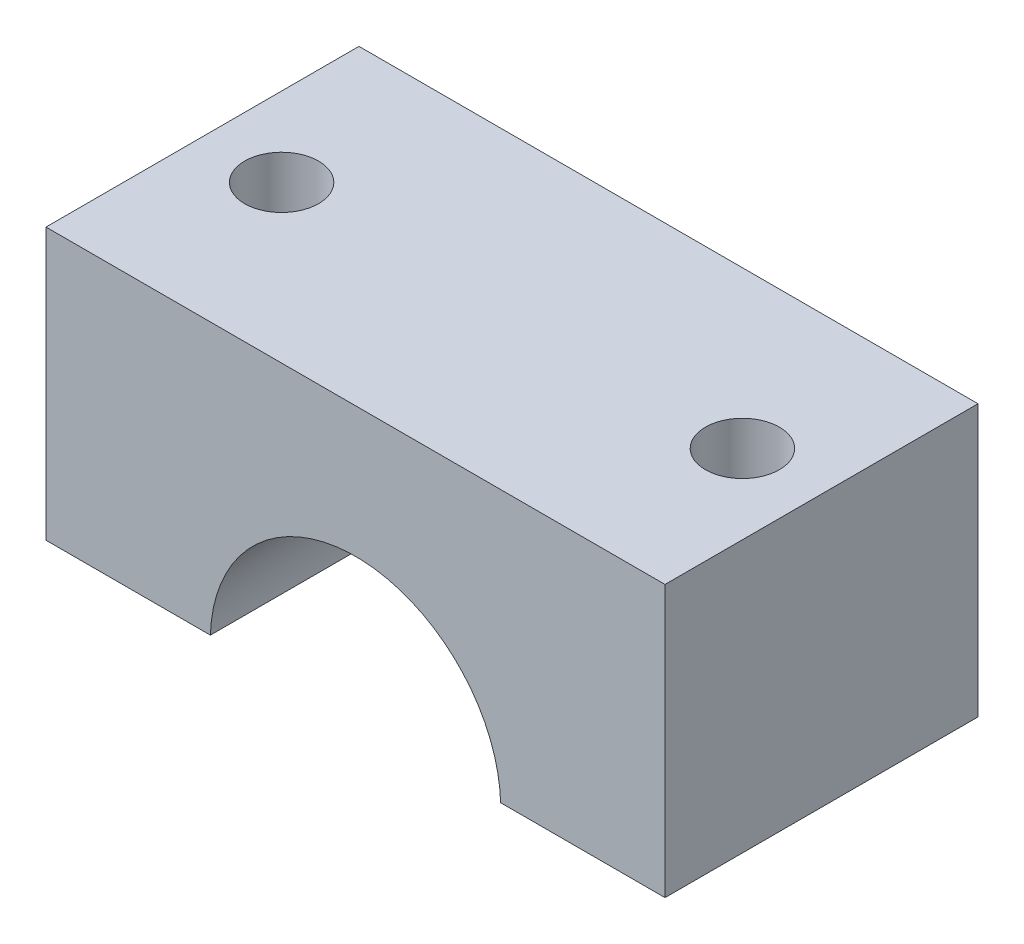
ISO-10303-21;
HEADER;
FILE_DESCRIPTION(('STEP AP214'),'2;1');
FILE_NAME('part.step','',(''),(''),'','','');
FILE_SCHEMA(('AUTOMOTIVE_DESIGN { 1 0 10303 214 1 1 1 1 }'));
ENDSEC;
DATA;
#1=APPLICATION_CONTEXT('core data for automotive mechanical design processes');
#2=APPLICATION_PROTOCOL_DEFINITION('international standard','automotive_design',2000,#1);
#3=PRODUCT_CONTEXT('',#1,'mechanical');
#4=PRODUCT('Part','Part','',(#3));
#5=PRODUCT_RELATED_PRODUCT_CATEGORY('part','',(#4));
#6=PRODUCT_DEFINITION_FORMATION('','',#4);
#7=PRODUCT_DEFINITION_CONTEXT('part definition',#1,'design');
#8=PRODUCT_DEFINITION('design','',#6,#7);
#9=PRODUCT_DEFINITION_SHAPE('','',#8);
#10=(LENGTH_UNIT() NAMED_UNIT(*) SI_UNIT(.MILLI.,.METRE.));
#11=(NAMED_UNIT(*) PLANE_ANGLE_UNIT() SI_UNIT($,.RADIAN.));
#12=(NAMED_UNIT(*) SI_UNIT($,.STERADIAN.) SOLID_ANGLE_UNIT());
#13=UNCERTAINTY_MEASURE_WITH_UNIT(LENGTH_MEASURE(1.E-05),#10,'distance_accuracy_value','');
#14=(GEOMETRIC_REPRESENTATION_CONTEXT(3) GLOBAL_UNCERTAINTY_ASSIGNED_CONTEXT((#13)) GLOBAL_UNIT_ASSIGNED_CONTEXT((#10,
#11,#12)) REPRESENTATION_CONTEXT('',''));
#15=CARTESIAN_POINT('',(0.,0.,0.));
#16=DIRECTION('',(0.,0.,1.));
#17=DIRECTION('',(1.,0.,0.));
#18=AXIS2_PLACEMENT_3D('',#15,#16,#17);
#19=CARTESIAN_POINT('',(-109.129829318576,1.35190328140605,36.));
#20=DIRECTION('',(0.,0.,-1.));
#21=DIRECTION('',(-1.,0.,0.));
#22=AXIS2_PLACEMENT_3D('',#19,#20,#21);
#23=CYLINDRICAL_SURFACE('',#22,16.7);
#24=DIRECTION('',(0.,0.,-1.));
#25=VECTOR('',#24,1.);
#26=CARTESIAN_POINT('',(-92.4373160266834,1.85190328140605,36.));
#27=LINE('',#26,#25);
#28=CARTESIAN_POINT('',(-92.4373160266834,1.85190328140605,36.));
#29=VERTEX_POINT('',#28);
#30=CARTESIAN_POINT('',(-92.4373160266834,1.85190328140605,0.));
#31=VERTEX_POINT('',#30);
#32=EDGE_CURVE('E63',#29,#31,#27,.T.);
#33=ORIENTED_EDGE('',*,*,#32,.F.);
#34=CARTESIAN_POINT('',(-109.129829318576,1.35190328140605,36.));
#35=DIRECTION('',(0.,0.,1.));
#36=DIRECTION('',(1.,0.,0.));
#37=AXIS2_PLACEMENT_3D('',#34,#35,#36);
#38=CIRCLE('',#37,16.7);
#39=CARTESIAN_POINT('',(-125.822342610468,1.85190328140605,36.));
#40=VERTEX_POINT('',#39);
#41=EDGE_CURVE('E112',#29,#40,#38,.T.);
#42=ORIENTED_EDGE('',*,*,#41,.T.);
#43=DIRECTION('',(0.,0.,-1.));
#44=VECTOR('',#43,1.);
#45=CARTESIAN_POINT('',(-125.822342610468,1.85190328140605,36.));
#46=LINE('',#45,#44);
#47=CARTESIAN_POINT('',(-125.822342610468,1.85190328140605,0.));
#48=VERTEX_POINT('',#47);
#49=EDGE_CURVE('E163',#48,#40,#46,.F.);
#50=ORIENTED_EDGE('',*,*,#49,.F.);
#51=CARTESIAN_POINT('',(-109.129829318576,1.35190328140605,0.));
#52=DIRECTION('',(0.,0.,1.));
#53=DIRECTION('',(1.,0.,0.));
#54=AXIS2_PLACEMENT_3D('',#51,#52,#53);
#55=CIRCLE('',#54,16.7);
#56=EDGE_CURVE('E132',#31,#48,#55,.T.);
#57=ORIENTED_EDGE('',*,*,#56,.F.);
#58=EDGE_LOOP('',(#33,#42,#50,#57));
#59=FACE_BOUND('',#58,.T.);
#60=ADVANCED_FACE('F39',(#59),#23,.F.);
#61=CARTESIAN_POINT('',(-73.5298293185756,0.,36.));
#62=DIRECTION('',(1.,0.,0.));
#63=DIRECTION('',(0.,0.,-1.));
#64=AXIS2_PLACEMENT_3D('',#61,#62,#63);
#65=PLANE('',#64);
#66=DIRECTION('',(0.,0.,-1.));
#67=VECTOR('',#66,1.);
#68=CARTESIAN_POINT('',(-73.5298293185756,1.85190328140605,0.));
#69=LINE('',#68,#67);
#70=CARTESIAN_POINT('',(-73.5298293185756,1.85190328140605,36.));
#71=VERTEX_POINT('',#70);
#72=CARTESIAN_POINT('',(-73.5298293185756,1.85190328140605,0.));
#73=VERTEX_POINT('',#72);
#74=EDGE_CURVE('E90',#71,#73,#69,.T.);
#75=ORIENTED_EDGE('',*,*,#74,.T.);
#76=DIRECTION('',(0.,-1.,0.));
#77=VECTOR('',#76,1.);
#78=CARTESIAN_POINT('',(-73.5298293185756,0.,0.));
#79=LINE('',#78,#77);
#80=CARTESIAN_POINT('',(-73.5298293185756,33.051903281406,0.));
#81=VERTEX_POINT('',#80);
#82=EDGE_CURVE('E136',#81,#73,#79,.T.);
#83=ORIENTED_EDGE('',*,*,#82,.F.);
#84=DIRECTION('',(0.,0.,-1.));
#85=VECTOR('',#84,1.);
#86=CARTESIAN_POINT('',(-73.5298293185756,33.051903281406,36.));
#87=LINE('',#86,#85);
#88=CARTESIAN_POINT('',(-73.5298293185756,33.051903281406,36.));
#89=VERTEX_POINT('',#88);
#90=EDGE_CURVE('E11',#89,#81,#87,.T.);
#91=ORIENTED_EDGE('',*,*,#90,.F.);
#92=DIRECTION('',(0.,-1.,0.));
#93=VECTOR('',#92,1.);
#94=CARTESIAN_POINT('',(-73.5298293185756,0.,36.));
#95=LINE('',#94,#93);
#96=EDGE_CURVE('E108',#89,#71,#95,.T.);
#97=ORIENTED_EDGE('',*,*,#96,.T.);
#98=EDGE_LOOP('',(#75,#83,#91,#97));
#99=FACE_BOUND('',#98,.T.);
#100=ADVANCED_FACE('F116',(#99),#65,.T.);
#101=CARTESIAN_POINT('',(0.,33.051903281406,36.));
#102=DIRECTION('',(0.,1.,0.));
#103=DIRECTION('',(0.,0.,1.));
#104=AXIS2_PLACEMENT_3D('',#101,#102,#103);
#105=PLANE('',#104);
#106=CARTESIAN_POINT('',(-82.6285901186698,33.051903281406,18.));
#107=DIRECTION('',(0.,1.,0.));
#108=DIRECTION('',(0.,0.,1.));
#109=AXIS2_PLACEMENT_3D('',#106,#107,#108);
#110=CIRCLE('',#109,4.25);
#111=CARTESIAN_POINT('',(-82.6285901186698,33.051903281406,22.25));
#112=VERTEX_POINT('',#111);
#113=EDGE_CURVE('E137',#112,#112,#110,.T.);
#114=ORIENTED_EDGE('',*,*,#113,.F.);
#115=EDGE_LOOP('',(#114));
#116=FACE_BOUND('',#115,.T.);
#117=CARTESIAN_POINT('',(-135.631068518481,33.051903281406,18.));
#118=DIRECTION('',(0.,1.,0.));
#119=DIRECTION('',(0.,0.,1.));
#120=AXIS2_PLACEMENT_3D('',#117,#118,#119);
#121=CIRCLE('',#120,4.25);
#122=CARTESIAN_POINT('',(-135.631068518481,33.051903281406,22.25));
#123=VERTEX_POINT('',#122);
#124=EDGE_CURVE('E170',#123,#123,#121,.T.);
#125=ORIENTED_EDGE('',*,*,#124,.F.);
#126=EDGE_LOOP('',(#125));
#127=FACE_BOUND('',#126,.T.);
#128=DIRECTION('',(1.,0.,0.));
#129=VECTOR('',#128,1.);
#130=CARTESIAN_POINT('',(0.,33.051903281406,0.));
#131=LINE('',#130,#129);
#132=CARTESIAN_POINT('',(-144.729829318576,33.051903281406,0.));
#133=VERTEX_POINT('',#132);
#134=EDGE_CURVE('E140',#133,#81,#131,.T.);
#135=ORIENTED_EDGE('',*,*,#134,.F.);
#136=DIRECTION('',(0.,0.,-1.));
#137=VECTOR('',#136,1.);
#138=CARTESIAN_POINT('',(-144.729829318576,33.051903281406,36.));
#139=LINE('',#138,#137);
#140=CARTESIAN_POINT('',(-144.729829318576,33.051903281406,36.));
#141=VERTEX_POINT('',#140);
#142=EDGE_CURVE('E48',#141,#133,#139,.T.);
#143=ORIENTED_EDGE('',*,*,#142,.F.);
#144=DIRECTION('',(1.,0.,0.));
#145=VECTOR('',#144,1.);
#146=CARTESIAN_POINT('',(0.,33.051903281406,36.));
#147=LINE('',#146,#145);
#148=EDGE_CURVE('E118',#141,#89,#147,.T.);
#149=ORIENTED_EDGE('',*,*,#148,.T.);
#150=ORIENTED_EDGE('',*,*,#90,.T.);
#151=EDGE_LOOP('',(#135,#143,#149,#150));
#152=FACE_BOUND('',#151,.T.);
#153=ADVANCED_FACE('F157',(#116,#127,#152),#105,.T.);
#154=CARTESIAN_POINT('',(-144.729829318576,0.,36.));
#155=DIRECTION('',(1.,0.,0.));
#156=DIRECTION('',(0.,0.,-1.));
#157=AXIS2_PLACEMENT_3D('',#154,#155,#156);
#158=PLANE('',#157);
#159=DIRECTION('',(0.,-1.,0.));
#160=VECTOR('',#159,1.);
#161=CARTESIAN_POINT('',(-144.729829318576,0.,0.));
#162=LINE('',#161,#160);
#163=CARTESIAN_POINT('',(-144.729829318576,1.85190328140605,0.));
#164=VERTEX_POINT('',#163);
#165=EDGE_CURVE('E125',#133,#164,#162,.T.);
#166=ORIENTED_EDGE('',*,*,#165,.T.);
#167=DIRECTION('',(0.,0.,-1.));
#168=VECTOR('',#167,1.);
#169=CARTESIAN_POINT('',(-144.729829318576,1.85190328140605,0.));
#170=LINE('',#169,#168);
#171=CARTESIAN_POINT('',(-144.729829318576,1.85190328140605,36.));
#172=VERTEX_POINT('',#171);
#173=EDGE_CURVE('E55',#172,#164,#170,.T.);
#174=ORIENTED_EDGE('',*,*,#173,.F.);
#175=DIRECTION('',(0.,-1.,0.));
#176=VECTOR('',#175,1.);
#177=CARTESIAN_POINT('',(-144.729829318576,0.,36.));
#178=LINE('',#177,#176);
#179=EDGE_CURVE('E123',#141,#172,#178,.T.);
#180=ORIENTED_EDGE('',*,*,#179,.F.);
#181=ORIENTED_EDGE('',*,*,#142,.T.);
#182=EDGE_LOOP('',(#166,#174,#180,#181));
#183=FACE_BOUND('',#182,.T.);
#184=ADVANCED_FACE('F152',(#183),#158,.F.);
#185=CARTESIAN_POINT('',(0.,0.,36.));
#186=DIRECTION('',(0.,0.,1.));
#187=DIRECTION('',(1.,0.,0.));
#188=AXIS2_PLACEMENT_3D('',#185,#186,#187);
#189=PLANE('',#188);
#190=DIRECTION('',(-1.,0.,0.));
#191=VECTOR('',#190,1.);
#192=CARTESIAN_POINT('',(-73.5298293185756,1.85190328140605,36.));
#193=LINE('',#192,#191);
#194=EDGE_CURVE('E94',#71,#29,#193,.T.);
#195=ORIENTED_EDGE('',*,*,#194,.F.);
#196=ORIENTED_EDGE('',*,*,#96,.F.);
#197=ORIENTED_EDGE('',*,*,#148,.F.);
#198=ORIENTED_EDGE('',*,*,#179,.T.);
#199=EDGE_CURVE('E101',#40,#172,#193,.T.);
#200=ORIENTED_EDGE('',*,*,#199,.F.);
#201=ORIENTED_EDGE('',*,*,#41,.F.);
#202=EDGE_LOOP('',(#195,#196,#197,#198,#200,#201));
#203=FACE_BOUND('',#202,.T.);
#204=ADVANCED_FACE('F106',(#203),#189,.T.);
#205=CARTESIAN_POINT('',(0.,0.,0.));
#206=DIRECTION('',(0.,0.,1.));
#207=DIRECTION('',(1.,0.,0.));
#208=AXIS2_PLACEMENT_3D('',#205,#206,#207);
#209=PLANE('',#208);
#210=ORIENTED_EDGE('',*,*,#82,.T.);
#211=DIRECTION('',(-1.,0.,0.));
#212=VECTOR('',#211,1.);
#213=CARTESIAN_POINT('',(-73.5298293185756,1.85190328140605,0.));
#214=LINE('',#213,#212);
#215=EDGE_CURVE('E95',#73,#31,#214,.T.);
#216=ORIENTED_EDGE('',*,*,#215,.T.);
#217=ORIENTED_EDGE('',*,*,#56,.T.);
#218=EDGE_CURVE('E114',#48,#164,#214,.T.);
#219=ORIENTED_EDGE('',*,*,#218,.T.);
#220=ORIENTED_EDGE('',*,*,#165,.F.);
#221=ORIENTED_EDGE('',*,*,#134,.T.);
#222=EDGE_LOOP('',(#210,#216,#217,#219,#220,#221));
#223=FACE_BOUND('',#222,.T.);
#224=ADVANCED_FACE('F156',(#223),#209,.F.);
#225=CARTESIAN_POINT('',(-135.631068518481,1.35190328140605,18.));
#226=DIRECTION('',(0.,1.,0.));
#227=DIRECTION('',(0.,0.,1.));
#228=AXIS2_PLACEMENT_3D('',#225,#226,#227);
#229=CYLINDRICAL_SURFACE('',#228,4.25);
#230=CARTESIAN_POINT('',(-135.631068518481,1.85190328140605,18.));
#231=DIRECTION('',(0.,1.,0.));
#232=DIRECTION('',(0.,0.,1.));
#233=AXIS2_PLACEMENT_3D('',#230,#231,#232);
#234=CIRCLE('',#233,4.25);
#235=CARTESIAN_POINT('',(-135.631068518481,1.85190328140605,22.25));
#236=VERTEX_POINT('',#235);
#237=EDGE_CURVE('E165',#236,#236,#234,.F.);
#238=ORIENTED_EDGE('',*,*,#237,.T.);
#239=EDGE_LOOP('',(#238));
#240=FACE_BOUND('',#239,.T.);
#241=ORIENTED_EDGE('',*,*,#124,.T.);
#242=EDGE_LOOP('',(#241));
#243=FACE_BOUND('',#242,.T.);
#244=ADVANCED_FACE('F182',(#240,#243),#229,.F.);
#245=CARTESIAN_POINT('',(-82.6285901186698,1.35190328140605,18.));
#246=DIRECTION('',(0.,1.,0.));
#247=DIRECTION('',(0.,0.,1.));
#248=AXIS2_PLACEMENT_3D('',#245,#246,#247);
#249=CYLINDRICAL_SURFACE('',#248,4.25);
#250=CARTESIAN_POINT('',(-82.6285901186698,1.85190328140605,18.));
#251=DIRECTION('',(0.,1.,0.));
#252=DIRECTION('',(0.,0.,1.));
#253=AXIS2_PLACEMENT_3D('',#250,#251,#252);
#254=CIRCLE('',#253,4.25);
#255=CARTESIAN_POINT('',(-82.6285901186698,1.85190328140605,22.25));
#256=VERTEX_POINT('',#255);
#257=EDGE_CURVE('E42',#256,#256,#254,.F.);
#258=ORIENTED_EDGE('',*,*,#257,.T.);
#259=EDGE_LOOP('',(#258));
#260=FACE_BOUND('',#259,.T.);
#261=ORIENTED_EDGE('',*,*,#113,.T.);
#262=EDGE_LOOP('',(#261));
#263=FACE_BOUND('',#262,.T.);
#264=ADVANCED_FACE('F243',(#260,#263),#249,.F.);
#265=CARTESIAN_POINT('',(-73.5298293185756,1.85190328140605,0.));
#266=DIRECTION('',(0.,1.,0.));
#267=DIRECTION('',(0.,0.,1.));
#268=AXIS2_PLACEMENT_3D('',#265,#266,#267);
#269=PLANE('',#268);
#270=ORIENTED_EDGE('',*,*,#32,.T.);
#271=ORIENTED_EDGE('',*,*,#215,.F.);
#272=ORIENTED_EDGE('',*,*,#74,.F.);
#273=ORIENTED_EDGE('',*,*,#194,.T.);
#274=EDGE_LOOP('',(#270,#271,#272,#273));
#275=FACE_BOUND('',#274,.T.);
#276=ORIENTED_EDGE('',*,*,#257,.F.);
#277=EDGE_LOOP('',(#276));
#278=FACE_BOUND('',#277,.T.);
#279=ADVANCED_FACE('F92',(#275,#278),#269,.F.);
#280=ORIENTED_EDGE('',*,*,#49,.T.);
#281=ORIENTED_EDGE('',*,*,#199,.T.);
#282=ORIENTED_EDGE('',*,*,#173,.T.);
#283=ORIENTED_EDGE('',*,*,#218,.F.);
#284=EDGE_LOOP('',(#280,#281,#282,#283));
#285=FACE_BOUND('',#284,.T.);
#286=ORIENTED_EDGE('',*,*,#237,.F.);
#287=EDGE_LOOP('',(#286));
#288=FACE_BOUND('',#287,.T.);
#289=ADVANCED_FACE('F262',(#285,#288),#269,.F.);
#290=CLOSED_SHELL('',(#60,#100,#153,#184,#204,#224,#244,#264,#279,#289));
#291=MANIFOLD_SOLID_BREP('B2',#290);
#292=ADVANCED_BREP_SHAPE_REPRESENTATION('',(#18,#291),#14);
#293=SHAPE_DEFINITION_REPRESENTATION(#9,#292);
ENDSEC;
END-ISO-10303-21;
